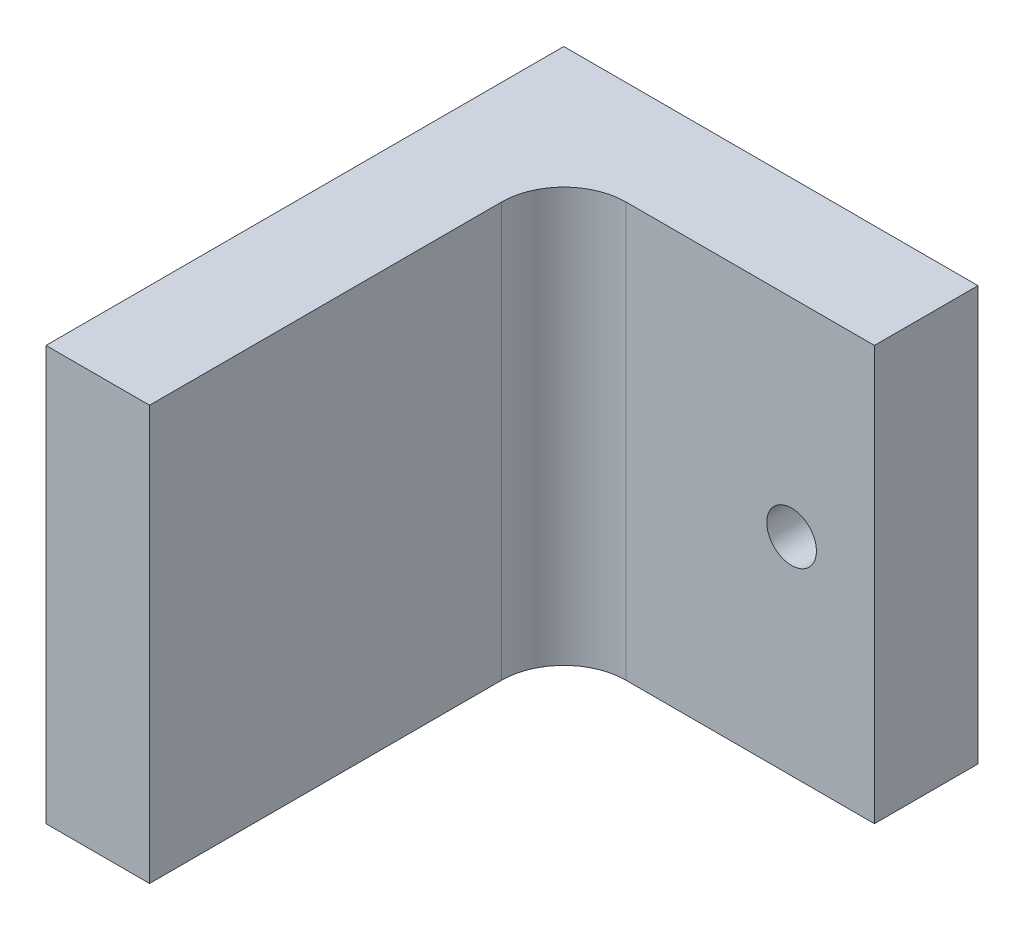
ISO-10303-21;
HEADER;
FILE_DESCRIPTION(('STEP AP214'),'2;1');
FILE_NAME('part.step','',(''),(''),'','','');
FILE_SCHEMA(('AUTOMOTIVE_DESIGN { 1 0 10303 214 1 1 1 1 }'));
ENDSEC;
DATA;
#1=APPLICATION_CONTEXT('core data for automotive mechanical design processes');
#2=APPLICATION_PROTOCOL_DEFINITION('international standard','automotive_design',2000,#1);
#3=PRODUCT_CONTEXT('',#1,'mechanical');
#4=PRODUCT('Part','Part','',(#3));
#5=PRODUCT_RELATED_PRODUCT_CATEGORY('part','',(#4));
#6=PRODUCT_DEFINITION_FORMATION('','',#4);
#7=PRODUCT_DEFINITION_CONTEXT('part definition',#1,'design');
#8=PRODUCT_DEFINITION('design','',#6,#7);
#9=PRODUCT_DEFINITION_SHAPE('','',#8);
#10=(LENGTH_UNIT() NAMED_UNIT(*) SI_UNIT(.MILLI.,.METRE.));
#11=(NAMED_UNIT(*) PLANE_ANGLE_UNIT() SI_UNIT($,.RADIAN.));
#12=(NAMED_UNIT(*) SI_UNIT($,.STERADIAN.) SOLID_ANGLE_UNIT());
#13=UNCERTAINTY_MEASURE_WITH_UNIT(LENGTH_MEASURE(1.E-05),#10,'distance_accuracy_value','');
#14=(GEOMETRIC_REPRESENTATION_CONTEXT(3) GLOBAL_UNCERTAINTY_ASSIGNED_CONTEXT((#13)) GLOBAL_UNIT_ASSIGNED_CONTEXT((#10,
#11,#12)) REPRESENTATION_CONTEXT('',''));
#15=CARTESIAN_POINT('',(0.,0.,0.));
#16=DIRECTION('',(0.,0.,1.));
#17=DIRECTION('',(1.,0.,0.));
#18=AXIS2_PLACEMENT_3D('',#15,#16,#17);
#19=CARTESIAN_POINT('',(0.,0.,5.));
#20=DIRECTION('',(0.,0.,-1.));
#21=DIRECTION('',(-1.,0.,0.));
#22=AXIS2_PLACEMENT_3D('',#19,#20,#21);
#23=PLANE('',#22);
#24=CARTESIAN_POINT('',(16.,10.,5.));
#25=DIRECTION('',(0.,0.,-1.));
#26=DIRECTION('',(-1.,0.,0.));
#27=AXIS2_PLACEMENT_3D('',#24,#25,#26);
#28=CIRCLE('',#27,1.2);
#29=CARTESIAN_POINT('',(14.8,10.,5.));
#30=VERTEX_POINT('',#29);
#31=EDGE_CURVE('E121',#30,#30,#28,.T.);
#32=ORIENTED_EDGE('',*,*,#31,.T.);
#33=EDGE_LOOP('',(#32));
#34=FACE_BOUND('',#33,.T.);
#35=DIRECTION('',(-1.,0.,0.));
#36=VECTOR('',#35,1.);
#37=CARTESIAN_POINT('',(0.,20.,5.));
#38=LINE('',#37,#36);
#39=CARTESIAN_POINT('',(20.,20.,5.));
#40=VERTEX_POINT('',#39);
#41=CARTESIAN_POINT('',(8.,20.,5.));
#42=VERTEX_POINT('',#41);
#43=EDGE_CURVE('E138',#40,#42,#38,.T.);
#44=ORIENTED_EDGE('',*,*,#43,.T.);
#45=DIRECTION('',(0.,1.,0.));
#46=VECTOR('',#45,1.);
#47=CARTESIAN_POINT('',(8.00000000000001,0.,5.));
#48=LINE('',#47,#46);
#49=CARTESIAN_POINT('',(8.00000000000001,0.,5.));
#50=VERTEX_POINT('',#49);
#51=EDGE_CURVE('E58',#42,#50,#48,.F.);
#52=ORIENTED_EDGE('',*,*,#51,.T.);
#53=DIRECTION('',(1.,0.,0.));
#54=VECTOR('',#53,1.);
#55=CARTESIAN_POINT('',(0.,0.,5.));
#56=LINE('',#55,#54);
#57=CARTESIAN_POINT('',(20.,0.,5.));
#58=VERTEX_POINT('',#57);
#59=EDGE_CURVE('E133',#50,#58,#56,.T.);
#60=ORIENTED_EDGE('',*,*,#59,.T.);
#61=DIRECTION('',(0.,1.,0.));
#62=VECTOR('',#61,1.);
#63=CARTESIAN_POINT('',(20.,0.,5.));
#64=LINE('',#63,#62);
#65=EDGE_CURVE('E135',#58,#40,#64,.T.);
#66=ORIENTED_EDGE('',*,*,#65,.T.);
#67=EDGE_LOOP('',(#44,#52,#60,#66));
#68=FACE_BOUND('',#67,.T.);
#69=ADVANCED_FACE('F37',(#34,#68),#23,.F.);
#70=CARTESIAN_POINT('',(0.,0.,5.));
#71=DIRECTION('',(1.,0.,0.));
#72=DIRECTION('',(0.,1.,0.));
#73=AXIS2_PLACEMENT_3D('',#70,#71,#72);
#74=PLANE('',#73);
#75=DIRECTION('',(0.,-1.,0.));
#76=VECTOR('',#75,1.);
#77=CARTESIAN_POINT('',(0.,0.,0.));
#78=LINE('',#77,#76);
#79=CARTESIAN_POINT('',(0.,20.,0.));
#80=VERTEX_POINT('',#79);
#81=CARTESIAN_POINT('',(0.,0.,0.));
#82=VERTEX_POINT('',#81);
#83=EDGE_CURVE('E103',#80,#82,#78,.T.);
#84=ORIENTED_EDGE('',*,*,#83,.T.);
#85=DIRECTION('',(0.,0.,-1.));
#86=VECTOR('',#85,1.);
#87=CARTESIAN_POINT('',(0.,0.,5.));
#88=LINE('',#87,#86);
#89=CARTESIAN_POINT('',(0.,0.,25.));
#90=VERTEX_POINT('',#89);
#91=EDGE_CURVE('E96',#90,#82,#88,.T.);
#92=ORIENTED_EDGE('',*,*,#91,.F.);
#93=DIRECTION('',(0.,-1.,0.));
#94=VECTOR('',#93,1.);
#95=CARTESIAN_POINT('',(0.,20.,25.));
#96=LINE('',#95,#94);
#97=CARTESIAN_POINT('',(0.,20.,25.));
#98=VERTEX_POINT('',#97);
#99=EDGE_CURVE('E101',#98,#90,#96,.T.);
#100=ORIENTED_EDGE('',*,*,#99,.F.);
#101=DIRECTION('',(0.,0.,-1.));
#102=VECTOR('',#101,1.);
#103=CARTESIAN_POINT('',(0.,20.,5.));
#104=LINE('',#103,#102);
#105=EDGE_CURVE('E140',#98,#80,#104,.T.);
#106=ORIENTED_EDGE('',*,*,#105,.T.);
#107=EDGE_LOOP('',(#84,#92,#100,#106));
#108=FACE_BOUND('',#107,.T.);
#109=ADVANCED_FACE('F98',(#108),#74,.F.);
#110=CARTESIAN_POINT('',(0.,0.,5.));
#111=DIRECTION('',(0.,1.,0.));
#112=DIRECTION('',(0.,0.,1.));
#113=AXIS2_PLACEMENT_3D('',#110,#111,#112);
#114=PLANE('',#113);
#115=DIRECTION('',(1.,0.,0.));
#116=VECTOR('',#115,1.);
#117=CARTESIAN_POINT('',(0.,0.,0.));
#118=LINE('',#117,#116);
#119=CARTESIAN_POINT('',(20.,0.,0.));
#120=VERTEX_POINT('',#119);
#121=EDGE_CURVE('E142',#82,#120,#118,.T.);
#122=ORIENTED_EDGE('',*,*,#121,.T.);
#123=DIRECTION('',(0.,0.,-1.));
#124=VECTOR('',#123,1.);
#125=CARTESIAN_POINT('',(20.,0.,5.));
#126=LINE('',#125,#124);
#127=EDGE_CURVE('E106',#58,#120,#126,.T.);
#128=ORIENTED_EDGE('',*,*,#127,.F.);
#129=ORIENTED_EDGE('',*,*,#59,.F.);
#130=CARTESIAN_POINT('',(8.00000000000001,0.,8.));
#131=DIRECTION('',(0.,1.,0.));
#132=DIRECTION('',(0.,0.,1.));
#133=AXIS2_PLACEMENT_3D('',#130,#131,#132);
#134=CIRCLE('',#133,3.);
#135=CARTESIAN_POINT('',(5.00000000000001,0.,8.));
#136=VERTEX_POINT('',#135);
#137=EDGE_CURVE('E11',#50,#136,#134,.T.);
#138=ORIENTED_EDGE('',*,*,#137,.T.);
#139=DIRECTION('',(0.,0.,-1.));
#140=VECTOR('',#139,1.);
#141=CARTESIAN_POINT('',(5.00000000000001,0.,25.));
#142=LINE('',#141,#140);
#143=CARTESIAN_POINT('',(5.00000000000001,0.,25.));
#144=VERTEX_POINT('',#143);
#145=EDGE_CURVE('E112',#144,#136,#142,.T.);
#146=ORIENTED_EDGE('',*,*,#145,.F.);
#147=DIRECTION('',(1.,0.,0.));
#148=VECTOR('',#147,1.);
#149=CARTESIAN_POINT('',(0.,0.,25.));
#150=LINE('',#149,#148);
#151=EDGE_CURVE('E109',#90,#144,#150,.T.);
#152=ORIENTED_EDGE('',*,*,#151,.F.);
#153=ORIENTED_EDGE('',*,*,#91,.T.);
#154=EDGE_LOOP('',(#122,#128,#129,#138,#146,#152,#153));
#155=FACE_BOUND('',#154,.T.);
#156=ADVANCED_FACE('F110',(#155),#114,.F.);
#157=CARTESIAN_POINT('',(20.,0.,5.));
#158=DIRECTION('',(-1.,0.,0.));
#159=DIRECTION('',(0.,0.,1.));
#160=AXIS2_PLACEMENT_3D('',#157,#158,#159);
#161=PLANE('',#160);
#162=DIRECTION('',(0.,1.,0.));
#163=VECTOR('',#162,1.);
#164=CARTESIAN_POINT('',(20.,0.,0.));
#165=LINE('',#164,#163);
#166=CARTESIAN_POINT('',(20.,20.,0.));
#167=VERTEX_POINT('',#166);
#168=EDGE_CURVE('E144',#120,#167,#165,.T.);
#169=ORIENTED_EDGE('',*,*,#168,.T.);
#170=DIRECTION('',(0.,0.,-1.));
#171=VECTOR('',#170,1.);
#172=CARTESIAN_POINT('',(20.,20.,5.));
#173=LINE('',#172,#171);
#174=EDGE_CURVE('E148',#40,#167,#173,.T.);
#175=ORIENTED_EDGE('',*,*,#174,.F.);
#176=ORIENTED_EDGE('',*,*,#65,.F.);
#177=ORIENTED_EDGE('',*,*,#127,.T.);
#178=EDGE_LOOP('',(#169,#175,#176,#177));
#179=FACE_BOUND('',#178,.T.);
#180=ADVANCED_FACE('F169',(#179),#161,.F.);
#181=CARTESIAN_POINT('',(0.,20.,5.));
#182=DIRECTION('',(0.,-1.,0.));
#183=DIRECTION('',(0.,0.,-1.));
#184=AXIS2_PLACEMENT_3D('',#181,#182,#183);
#185=PLANE('',#184);
#186=DIRECTION('',(-1.,0.,0.));
#187=VECTOR('',#186,1.);
#188=CARTESIAN_POINT('',(0.,20.,0.));
#189=LINE('',#188,#187);
#190=EDGE_CURVE('E136',#167,#80,#189,.T.);
#191=ORIENTED_EDGE('',*,*,#190,.T.);
#192=ORIENTED_EDGE('',*,*,#105,.F.);
#193=DIRECTION('',(-1.,0.,0.));
#194=VECTOR('',#193,1.);
#195=CARTESIAN_POINT('',(0.,20.,25.));
#196=LINE('',#195,#194);
#197=CARTESIAN_POINT('',(5.,20.,25.));
#198=VERTEX_POINT('',#197);
#199=EDGE_CURVE('E120',#198,#98,#196,.T.);
#200=ORIENTED_EDGE('',*,*,#199,.F.);
#201=DIRECTION('',(0.,0.,-1.));
#202=VECTOR('',#201,1.);
#203=CARTESIAN_POINT('',(5.,20.,25.));
#204=LINE('',#203,#202);
#205=CARTESIAN_POINT('',(5.,20.,8.));
#206=VERTEX_POINT('',#205);
#207=EDGE_CURVE('E130',#198,#206,#204,.T.);
#208=ORIENTED_EDGE('',*,*,#207,.T.);
#209=CARTESIAN_POINT('',(8.,20.,8.));
#210=DIRECTION('',(0.,-1.,0.));
#211=DIRECTION('',(0.,0.,-1.));
#212=AXIS2_PLACEMENT_3D('',#209,#210,#211);
#213=CIRCLE('',#212,3.);
#214=EDGE_CURVE('E45',#206,#42,#213,.T.);
#215=ORIENTED_EDGE('',*,*,#214,.T.);
#216=ORIENTED_EDGE('',*,*,#43,.F.);
#217=ORIENTED_EDGE('',*,*,#174,.T.);
#218=EDGE_LOOP('',(#191,#192,#200,#208,#215,#216,#217));
#219=FACE_BOUND('',#218,.T.);
#220=ADVANCED_FACE('F161',(#219),#185,.F.);
#221=CARTESIAN_POINT('',(0.,0.,0.));
#222=DIRECTION('',(0.,0.,-1.));
#223=DIRECTION('',(-1.,0.,0.));
#224=AXIS2_PLACEMENT_3D('',#221,#222,#223);
#225=PLANE('',#224);
#226=CARTESIAN_POINT('',(16.,10.,0.));
#227=DIRECTION('',(0.,0.,-1.));
#228=DIRECTION('',(-1.,0.,0.));
#229=AXIS2_PLACEMENT_3D('',#226,#227,#228);
#230=CIRCLE('',#229,1.2);
#231=CARTESIAN_POINT('',(14.8,10.,0.));
#232=VERTEX_POINT('',#231);
#233=EDGE_CURVE('E124',#232,#232,#230,.T.);
#234=ORIENTED_EDGE('',*,*,#233,.F.);
#235=EDGE_LOOP('',(#234));
#236=FACE_BOUND('',#235,.T.);
#237=ORIENTED_EDGE('',*,*,#83,.F.);
#238=ORIENTED_EDGE('',*,*,#190,.F.);
#239=ORIENTED_EDGE('',*,*,#168,.F.);
#240=ORIENTED_EDGE('',*,*,#121,.F.);
#241=EDGE_LOOP('',(#237,#238,#239,#240));
#242=FACE_BOUND('',#241,.T.);
#243=ADVANCED_FACE('F164',(#236,#242),#225,.T.);
#244=CARTESIAN_POINT('',(5.,20.,25.));
#245=DIRECTION('',(-1.,0.,0.));
#246=DIRECTION('',(0.,-1.,0.));
#247=AXIS2_PLACEMENT_3D('',#244,#245,#246);
#248=PLANE('',#247);
#249=ORIENTED_EDGE('',*,*,#145,.T.);
#250=DIRECTION('',(0.,1.,0.));
#251=VECTOR('',#250,1.);
#252=CARTESIAN_POINT('',(5.,20.,8.));
#253=LINE('',#252,#251);
#254=EDGE_CURVE('E105',#136,#206,#253,.T.);
#255=ORIENTED_EDGE('',*,*,#254,.T.);
#256=ORIENTED_EDGE('',*,*,#207,.F.);
#257=DIRECTION('',(0.,1.,0.));
#258=VECTOR('',#257,1.);
#259=CARTESIAN_POINT('',(5.,20.,25.));
#260=LINE('',#259,#258);
#261=EDGE_CURVE('E115',#144,#198,#260,.T.);
#262=ORIENTED_EDGE('',*,*,#261,.F.);
#263=EDGE_LOOP('',(#249,#255,#256,#262));
#264=FACE_BOUND('',#263,.T.);
#265=ADVANCED_FACE('F158',(#264),#248,.F.);
#266=CARTESIAN_POINT('',(0.,0.,25.));
#267=DIRECTION('',(0.,0.,1.));
#268=DIRECTION('',(1.,0.,0.));
#269=AXIS2_PLACEMENT_3D('',#266,#267,#268);
#270=PLANE('',#269);
#271=ORIENTED_EDGE('',*,*,#99,.T.);
#272=ORIENTED_EDGE('',*,*,#151,.T.);
#273=ORIENTED_EDGE('',*,*,#261,.T.);
#274=ORIENTED_EDGE('',*,*,#199,.T.);
#275=EDGE_LOOP('',(#271,#272,#273,#274));
#276=FACE_BOUND('',#275,.T.);
#277=ADVANCED_FACE('F118',(#276),#270,.T.);
#278=CARTESIAN_POINT('',(8.,20.,8.));
#279=DIRECTION('',(0.,-1.,0.));
#280=DIRECTION('',(1.,0.,0.));
#281=AXIS2_PLACEMENT_3D('',#278,#279,#280);
#282=CYLINDRICAL_SURFACE('',#281,3.);
#283=ORIENTED_EDGE('',*,*,#137,.F.);
#284=ORIENTED_EDGE('',*,*,#51,.F.);
#285=ORIENTED_EDGE('',*,*,#214,.F.);
#286=ORIENTED_EDGE('',*,*,#254,.F.);
#287=EDGE_LOOP('',(#283,#284,#285,#286));
#288=FACE_BOUND('',#287,.T.);
#289=ADVANCED_FACE('F39',(#288),#282,.F.);
#290=CARTESIAN_POINT('',(16.,10.,20.));
#291=DIRECTION('',(0.,0.,-1.));
#292=DIRECTION('',(-1.,0.,0.));
#293=AXIS2_PLACEMENT_3D('',#290,#291,#292);
#294=CYLINDRICAL_SURFACE('',#293,1.2);
#295=ORIENTED_EDGE('',*,*,#233,.T.);
#296=EDGE_LOOP('',(#295));
#297=FACE_BOUND('',#296,.T.);
#298=ORIENTED_EDGE('',*,*,#31,.F.);
#299=EDGE_LOOP('',(#298));
#300=FACE_BOUND('',#299,.T.);
#301=ADVANCED_FACE('F172',(#297,#300),#294,.F.);
#302=CLOSED_SHELL('',(#69,#109,#156,#180,#220,#243,#265,#277,#289,#301));
#303=MANIFOLD_SOLID_BREP('B2',#302);
#304=ADVANCED_BREP_SHAPE_REPRESENTATION('',(#18,#303),#14);
#305=SHAPE_DEFINITION_REPRESENTATION(#9,#304);
ENDSEC;
END-ISO-10303-21;
